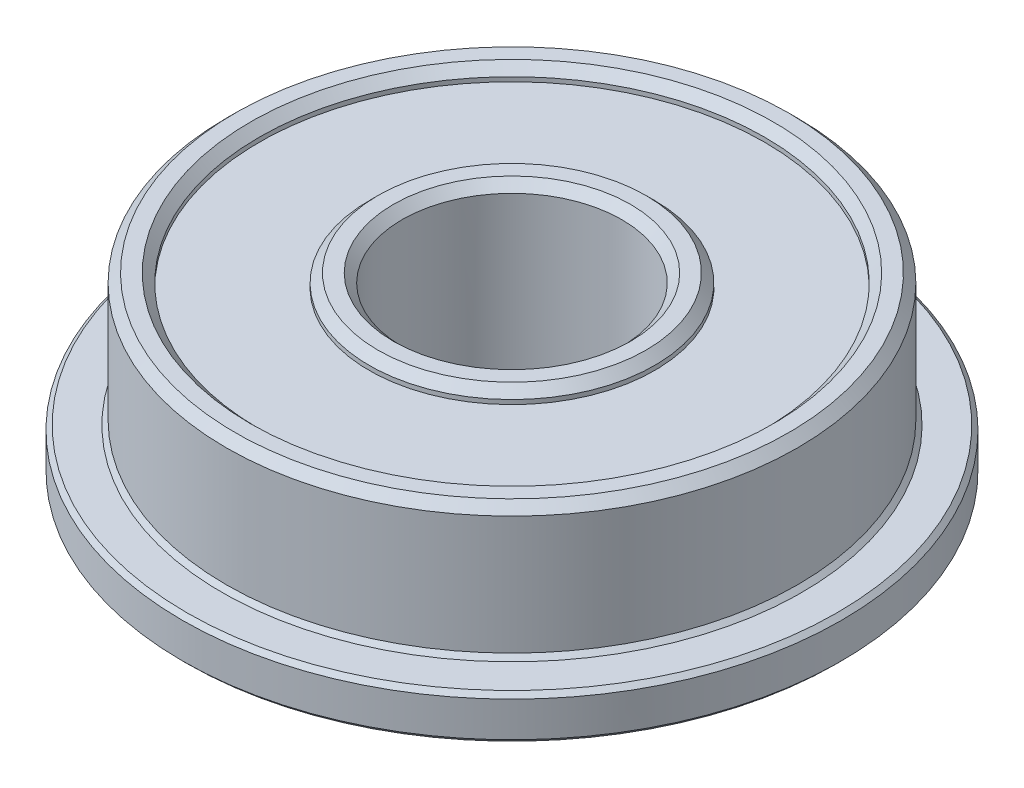
ISO-10303-21;
HEADER;
FILE_DESCRIPTION(('STEP AP214'),'2;1');
FILE_NAME('part.step','',(''),(''),'','','');
FILE_SCHEMA(('AUTOMOTIVE_DESIGN { 1 0 10303 214 1 1 1 1 }'));
ENDSEC;
DATA;
#1=APPLICATION_CONTEXT('core data for automotive mechanical design processes');
#2=APPLICATION_PROTOCOL_DEFINITION('international standard','automotive_design',2000,#1);
#3=PRODUCT_CONTEXT('',#1,'mechanical');
#4=PRODUCT('Part','Part','',(#3));
#5=PRODUCT_RELATED_PRODUCT_CATEGORY('part','',(#4));
#6=PRODUCT_DEFINITION_FORMATION('','',#4);
#7=PRODUCT_DEFINITION_CONTEXT('part definition',#1,'design');
#8=PRODUCT_DEFINITION('design','',#6,#7);
#9=PRODUCT_DEFINITION_SHAPE('','',#8);
#10=(LENGTH_UNIT() NAMED_UNIT(*) SI_UNIT(.MILLI.,.METRE.));
#11=(NAMED_UNIT(*) PLANE_ANGLE_UNIT() SI_UNIT($,.RADIAN.));
#12=(NAMED_UNIT(*) SI_UNIT($,.STERADIAN.) SOLID_ANGLE_UNIT());
#13=UNCERTAINTY_MEASURE_WITH_UNIT(LENGTH_MEASURE(1.E-05),#10,'distance_accuracy_value','');
#14=(GEOMETRIC_REPRESENTATION_CONTEXT(3) GLOBAL_UNCERTAINTY_ASSIGNED_CONTEXT((#13)) GLOBAL_UNIT_ASSIGNED_CONTEXT((#10,
#11,#12)) REPRESENTATION_CONTEXT('',''));
#15=CARTESIAN_POINT('',(0.,0.,0.));
#16=DIRECTION('',(0.,0.,1.));
#17=DIRECTION('',(1.,0.,0.));
#18=AXIS2_PLACEMENT_3D('',#15,#16,#17);
#19=CARTESIAN_POINT('',(0.,0.,0.));
#20=DIRECTION('',(0.,-1.,0.));
#21=DIRECTION('',(0.,0.,-1.));
#22=AXIS2_PLACEMENT_3D('',#19,#20,#21);
#23=PLANE('',#22);
#24=CARTESIAN_POINT('',(0.,0.,0.));
#25=DIRECTION('',(0.,-1.,0.));
#26=DIRECTION('',(0.,0.,-1.));
#27=AXIS2_PLACEMENT_3D('',#24,#25,#26);
#28=CIRCLE('',#27,2.69999999994752);
#29=CARTESIAN_POINT('',(0.,0.,-2.69999999994752));
#30=VERTEX_POINT('',#29);
#31=EDGE_CURVE('E18',#30,#30,#28,.F.);
#32=ORIENTED_EDGE('',*,*,#31,.T.);
#33=EDGE_LOOP('',(#32));
#34=FACE_BOUND('',#33,.T.);
#35=CARTESIAN_POINT('',(0.,-5.68433917557537E-11,0.));
#36=DIRECTION('',(0.,1.,0.));
#37=DIRECTION('',(0.,0.,1.));
#38=AXIS2_PLACEMENT_3D('',#35,#36,#37);
#39=CIRCLE('',#38,3.0500000000302);
#40=CARTESIAN_POINT('',(0.,-5.68440531190789E-11,3.0500000000302));
#41=VERTEX_POINT('',#40);
#42=EDGE_CURVE('E58',#41,#41,#39,.T.);
#43=ORIENTED_EDGE('',*,*,#42,.F.);
#44=EDGE_LOOP('',(#43));
#45=FACE_BOUND('',#44,.T.);
#46=ADVANCED_FACE('F15',(#34,#45),#23,.T.);
#47=CARTESIAN_POINT('',(0.,0.,0.));
#48=DIRECTION('',(0.,-1.,0.));
#49=DIRECTION('',(0.,0.,-1.));
#50=AXIS2_PLACEMENT_3D('',#47,#48,#49);
#51=CONICAL_SURFACE('',#50,2.69999999994752,0.785398163397448);
#52=ORIENTED_EDGE('',*,*,#31,.F.);
#53=EDGE_LOOP('',(#52));
#54=FACE_BOUND('',#53,.T.);
#55=CARTESIAN_POINT('',(0.,0.2,0.));
#56=DIRECTION('',(0.,-1.,0.));
#57=DIRECTION('',(0.,0.,-1.));
#58=AXIS2_PLACEMENT_3D('',#55,#56,#57);
#59=CIRCLE('',#58,2.5);
#60=CARTESIAN_POINT('',(0.,0.200000000000001,-2.5));
#61=VERTEX_POINT('',#60);
#62=EDGE_CURVE('E55',#61,#61,#59,.F.);
#63=ORIENTED_EDGE('',*,*,#62,.T.);
#64=EDGE_LOOP('',(#63));
#65=FACE_BOUND('',#64,.T.);
#66=ADVANCED_FACE('F99',(#54,#65),#51,.F.);
#67=CARTESIAN_POINT('',(0.,0.199999999836109,0.));
#68=DIRECTION('',(0.,1.,0.));
#69=DIRECTION('',(0.,0.,1.));
#70=AXIS2_PLACEMENT_3D('',#67,#68,#69);
#71=CONICAL_SURFACE('',#70,3.24999999992315,0.785398163397448);
#72=ORIENTED_EDGE('',*,*,#42,.T.);
#73=EDGE_LOOP('',(#72));
#74=FACE_BOUND('',#73,.T.);
#75=CARTESIAN_POINT('',(0.,0.2,0.));
#76=DIRECTION('',(0.,1.,0.));
#77=DIRECTION('',(0.,0.,1.));
#78=AXIS2_PLACEMENT_3D('',#75,#76,#77);
#79=CIRCLE('',#78,3.25);
#80=CARTESIAN_POINT('',(0.,0.199999999999999,3.25));
#81=VERTEX_POINT('',#80);
#82=EDGE_CURVE('E51',#81,#81,#79,.T.);
#83=ORIENTED_EDGE('',*,*,#82,.F.);
#84=EDGE_LOOP('',(#83));
#85=FACE_BOUND('',#84,.T.);
#86=ADVANCED_FACE('F102',(#74,#85),#71,.T.);
#87=CARTESIAN_POINT('',(0.,4.,0.));
#88=DIRECTION('',(0.,-1.,0.));
#89=DIRECTION('',(0.,0.,-1.));
#90=AXIS2_PLACEMENT_3D('',#87,#88,#89);
#91=CYLINDRICAL_SURFACE('',#90,2.5);
#92=ORIENTED_EDGE('',*,*,#62,.F.);
#93=EDGE_LOOP('',(#92));
#94=FACE_BOUND('',#93,.T.);
#95=CARTESIAN_POINT('',(0.,3.79999999995562,0.));
#96=DIRECTION('',(0.,1.,0.));
#97=DIRECTION('',(-1.,0.,0.));
#98=AXIS2_PLACEMENT_3D('',#95,#96,#97);
#99=CIRCLE('',#98,2.49999999994088);
#100=CARTESIAN_POINT('',(-2.49999999994088,3.79999999995562,0.));
#101=VERTEX_POINT('',#100);
#102=EDGE_CURVE('E54',#101,#101,#99,.T.);
#103=ORIENTED_EDGE('',*,*,#102,.T.);
#104=EDGE_LOOP('',(#103));
#105=FACE_BOUND('',#104,.T.);
#106=ADVANCED_FACE('F105',(#94,#105),#91,.F.);
#107=CARTESIAN_POINT('',(0.,0.,0.));
#108=DIRECTION('',(0.,1.,0.));
#109=DIRECTION('',(0.,0.,1.));
#110=AXIS2_PLACEMENT_3D('',#107,#108,#109);
#111=CYLINDRICAL_SURFACE('',#110,3.25);
#112=ORIENTED_EDGE('',*,*,#82,.T.);
#113=EDGE_LOOP('',(#112));
#114=FACE_BOUND('',#113,.T.);
#115=CARTESIAN_POINT('',(0.,0.3,0.));
#116=DIRECTION('',(0.,1.,0.));
#117=DIRECTION('',(0.,0.,1.));
#118=AXIS2_PLACEMENT_3D('',#115,#116,#117);
#119=CIRCLE('',#118,3.25);
#120=CARTESIAN_POINT('',(0.,0.299999999999999,3.25));
#121=VERTEX_POINT('',#120);
#122=EDGE_CURVE('E61',#121,#121,#119,.T.);
#123=ORIENTED_EDGE('',*,*,#122,.F.);
#124=EDGE_LOOP('',(#123));
#125=FACE_BOUND('',#124,.T.);
#126=ADVANCED_FACE('F108',(#114,#125),#111,.T.);
#127=CARTESIAN_POINT('',(0.,4.0000000000191,0.));
#128=DIRECTION('',(0.,1.,0.));
#129=DIRECTION('',(0.,0.,1.));
#130=AXIS2_PLACEMENT_3D('',#127,#128,#129);
#131=CONICAL_SURFACE('',#130,2.70000000000437,0.785398163397448);
#132=CARTESIAN_POINT('',(0.,4.0000000000191,0.));
#133=DIRECTION('',(0.,1.,0.));
#134=DIRECTION('',(0.,0.,1.));
#135=AXIS2_PLACEMENT_3D('',#132,#133,#134);
#136=CIRCLE('',#135,2.70000000000437);
#137=CARTESIAN_POINT('',(0.,4.0000000000191,2.70000000000437));
#138=VERTEX_POINT('',#137);
#139=EDGE_CURVE('E87',#138,#138,#136,.F.);
#140=ORIENTED_EDGE('',*,*,#139,.F.);
#141=EDGE_LOOP('',(#140));
#142=FACE_BOUND('',#141,.T.);
#143=ORIENTED_EDGE('',*,*,#102,.F.);
#144=EDGE_LOOP('',(#143));
#145=FACE_BOUND('',#144,.T.);
#146=ADVANCED_FACE('F112',(#142,#145),#131,.F.);
#147=CARTESIAN_POINT('',(0.,0.3,0.));
#148=DIRECTION('',(0.,-1.,0.));
#149=DIRECTION('',(0.,0.,-1.));
#150=AXIS2_PLACEMENT_3D('',#147,#148,#149);
#151=PLANE('',#150);
#152=ORIENTED_EDGE('',*,*,#122,.T.);
#153=EDGE_LOOP('',(#152));
#154=FACE_BOUND('',#153,.T.);
#155=CARTESIAN_POINT('',(0.,0.3,0.));
#156=DIRECTION('',(0.,1.,0.));
#157=DIRECTION('',(0.,0.,1.));
#158=AXIS2_PLACEMENT_3D('',#155,#156,#157);
#159=CIRCLE('',#158,5.75);
#160=CARTESIAN_POINT('',(0.,0.299999999999999,5.75));
#161=VERTEX_POINT('',#160);
#162=EDGE_CURVE('E84',#161,#161,#159,.F.);
#163=ORIENTED_EDGE('',*,*,#162,.T.);
#164=EDGE_LOOP('',(#163));
#165=FACE_BOUND('',#164,.T.);
#166=ADVANCED_FACE('F114',(#154,#165),#151,.T.);
#167=CARTESIAN_POINT('',(0.,4.,0.));
#168=DIRECTION('',(0.,1.,0.));
#169=DIRECTION('',(0.,0.,1.));
#170=AXIS2_PLACEMENT_3D('',#167,#168,#169);
#171=PLANE('',#170);
#172=ORIENTED_EDGE('',*,*,#139,.T.);
#173=EDGE_LOOP('',(#172));
#174=FACE_BOUND('',#173,.T.);
#175=CARTESIAN_POINT('',(0.,3.99999999996226,0.));
#176=DIRECTION('',(0.,-1.,0.));
#177=DIRECTION('',(0.,0.,-1.));
#178=AXIS2_PLACEMENT_3D('',#175,#176,#177);
#179=CIRCLE('',#178,3.0500000000302);
#180=CARTESIAN_POINT('',(0.,3.99999999996226,-3.05000000003019));
#181=VERTEX_POINT('',#180);
#182=EDGE_CURVE('E50',#181,#181,#179,.T.);
#183=ORIENTED_EDGE('',*,*,#182,.F.);
#184=EDGE_LOOP('',(#183));
#185=FACE_BOUND('',#184,.T.);
#186=ADVANCED_FACE('F122',(#174,#185),#171,.T.);
#187=CARTESIAN_POINT('',(0.,0.,0.));
#188=DIRECTION('',(0.,1.,0.));
#189=DIRECTION('',(0.,0.,1.));
#190=AXIS2_PLACEMENT_3D('',#187,#188,#189);
#191=CYLINDRICAL_SURFACE('',#190,5.75);
#192=ORIENTED_EDGE('',*,*,#162,.F.);
#193=EDGE_LOOP('',(#192));
#194=FACE_BOUND('',#193,.T.);
#195=CARTESIAN_POINT('',(0.,0.200000000006639,0.));
#196=DIRECTION('',(0.,-1.,0.));
#197=DIRECTION('',(1.,0.,0.));
#198=AXIS2_PLACEMENT_3D('',#195,#196,#197);
#199=CIRCLE('',#198,5.75000000003456);
#200=CARTESIAN_POINT('',(5.75000000003456,0.200000000006639,0.));
#201=VERTEX_POINT('',#200);
#202=EDGE_CURVE('E47',#201,#201,#199,.T.);
#203=ORIENTED_EDGE('',*,*,#202,.T.);
#204=EDGE_LOOP('',(#203));
#205=FACE_BOUND('',#204,.T.);
#206=ADVANCED_FACE('F190',(#194,#205),#191,.F.);
#207=CARTESIAN_POINT('',(0.,3.80000000001246,0.));
#208=DIRECTION('',(0.,-1.,0.));
#209=DIRECTION('',(0.,0.,-1.));
#210=AXIS2_PLACEMENT_3D('',#207,#208,#209);
#211=CONICAL_SURFACE('',#210,3.24999999997999,0.785398163397448);
#212=ORIENTED_EDGE('',*,*,#182,.T.);
#213=EDGE_LOOP('',(#212));
#214=FACE_BOUND('',#213,.T.);
#215=CARTESIAN_POINT('',(0.,3.8,0.));
#216=DIRECTION('',(0.,-1.,0.));
#217=DIRECTION('',(0.,0.,-1.));
#218=AXIS2_PLACEMENT_3D('',#215,#216,#217);
#219=CIRCLE('',#218,3.25);
#220=CARTESIAN_POINT('',(0.,3.8,-3.25));
#221=VERTEX_POINT('',#220);
#222=EDGE_CURVE('E43',#221,#221,#219,.T.);
#223=ORIENTED_EDGE('',*,*,#222,.F.);
#224=EDGE_LOOP('',(#223));
#225=FACE_BOUND('',#224,.T.);
#226=ADVANCED_FACE('F186',(#214,#225),#211,.T.);
#227=CARTESIAN_POINT('',(0.,5.6843418860808E-11,0.));
#228=DIRECTION('',(0.,-1.,0.));
#229=DIRECTION('',(0.,0.,-1.));
#230=AXIS2_PLACEMENT_3D('',#227,#228,#229);
#231=CONICAL_SURFACE('',#230,5.94999999998436,0.785398163397448);
#232=CARTESIAN_POINT('',(0.,0.,0.));
#233=DIRECTION('',(0.,-1.,0.));
#234=DIRECTION('',(0.,0.,-1.));
#235=AXIS2_PLACEMENT_3D('',#232,#233,#234);
#236=CIRCLE('',#235,5.9500000000412);
#237=CARTESIAN_POINT('',(0.,0.,-5.9500000000412));
#238=VERTEX_POINT('',#237);
#239=EDGE_CURVE('E46',#238,#238,#236,.F.);
#240=ORIENTED_EDGE('',*,*,#239,.F.);
#241=EDGE_LOOP('',(#240));
#242=FACE_BOUND('',#241,.T.);
#243=ORIENTED_EDGE('',*,*,#202,.F.);
#244=EDGE_LOOP('',(#243));
#245=FACE_BOUND('',#244,.T.);
#246=ADVANCED_FACE('F182',(#242,#245),#231,.F.);
#247=CARTESIAN_POINT('',(0.,4.,0.));
#248=DIRECTION('',(0.,-1.,0.));
#249=DIRECTION('',(0.,0.,-1.));
#250=AXIS2_PLACEMENT_3D('',#247,#248,#249);
#251=CYLINDRICAL_SURFACE('',#250,3.25);
#252=ORIENTED_EDGE('',*,*,#222,.T.);
#253=EDGE_LOOP('',(#252));
#254=FACE_BOUND('',#253,.T.);
#255=CARTESIAN_POINT('',(0.,3.7,0.));
#256=DIRECTION('',(0.,-1.,0.));
#257=DIRECTION('',(0.,0.,-1.));
#258=AXIS2_PLACEMENT_3D('',#255,#256,#257);
#259=CIRCLE('',#258,3.25);
#260=CARTESIAN_POINT('',(0.,3.7,-3.25));
#261=VERTEX_POINT('',#260);
#262=EDGE_CURVE('E77',#261,#261,#259,.T.);
#263=ORIENTED_EDGE('',*,*,#262,.F.);
#264=EDGE_LOOP('',(#263));
#265=FACE_BOUND('',#264,.T.);
#266=ADVANCED_FACE('F178',(#254,#265),#251,.T.);
#267=CARTESIAN_POINT('',(0.,0.,0.));
#268=DIRECTION('',(0.,-1.,0.));
#269=DIRECTION('',(0.,0.,-1.));
#270=AXIS2_PLACEMENT_3D('',#267,#268,#269);
#271=PLANE('',#270);
#272=ORIENTED_EDGE('',*,*,#239,.T.);
#273=EDGE_LOOP('',(#272));
#274=FACE_BOUND('',#273,.T.);
#275=CARTESIAN_POINT('',(0.,0.,0.));
#276=DIRECTION('',(0.,1.,0.));
#277=DIRECTION('',(0.,0.,1.));
#278=AXIS2_PLACEMENT_3D('',#275,#276,#277);
#279=CIRCLE('',#278,7.4);
#280=CARTESIAN_POINT('',(0.,0.,7.4));
#281=VERTEX_POINT('',#280);
#282=EDGE_CURVE('E74',#281,#281,#279,.T.);
#283=ORIENTED_EDGE('',*,*,#282,.F.);
#284=EDGE_LOOP('',(#283));
#285=FACE_BOUND('',#284,.T.);
#286=ADVANCED_FACE('F174',(#274,#285),#271,.T.);
#287=CARTESIAN_POINT('',(0.,3.7,0.));
#288=DIRECTION('',(0.,1.,0.));
#289=DIRECTION('',(0.,0.,1.));
#290=AXIS2_PLACEMENT_3D('',#287,#288,#289);
#291=PLANE('',#290);
#292=ORIENTED_EDGE('',*,*,#262,.T.);
#293=EDGE_LOOP('',(#292));
#294=FACE_BOUND('',#293,.T.);
#295=CARTESIAN_POINT('',(0.,3.7,0.));
#296=DIRECTION('',(0.,-1.,0.));
#297=DIRECTION('',(0.,0.,-1.));
#298=AXIS2_PLACEMENT_3D('',#295,#296,#297);
#299=CIRCLE('',#298,5.75);
#300=CARTESIAN_POINT('',(0.,3.7,-5.75));
#301=VERTEX_POINT('',#300);
#302=EDGE_CURVE('E36',#301,#301,#299,.F.);
#303=ORIENTED_EDGE('',*,*,#302,.T.);
#304=EDGE_LOOP('',(#303));
#305=FACE_BOUND('',#304,.T.);
#306=ADVANCED_FACE('F170',(#294,#305),#291,.T.);
#307=CARTESIAN_POINT('',(0.,0.100000000000001,0.));
#308=DIRECTION('',(0.,1.,0.));
#309=DIRECTION('',(0.,0.,1.));
#310=AXIS2_PLACEMENT_3D('',#307,#308,#309);
#311=CONICAL_SURFACE('',#310,7.5,0.785398163397449);
#312=ORIENTED_EDGE('',*,*,#282,.T.);
#313=EDGE_LOOP('',(#312));
#314=FACE_BOUND('',#313,.T.);
#315=CARTESIAN_POINT('',(0.,0.1,0.));
#316=DIRECTION('',(0.,1.,0.));
#317=DIRECTION('',(0.,0.,1.));
#318=AXIS2_PLACEMENT_3D('',#315,#316,#317);
#319=CIRCLE('',#318,7.5);
#320=CARTESIAN_POINT('',(0.,0.1,7.5));
#321=VERTEX_POINT('',#320);
#322=EDGE_CURVE('E32',#321,#321,#319,.T.);
#323=ORIENTED_EDGE('',*,*,#322,.F.);
#324=EDGE_LOOP('',(#323));
#325=FACE_BOUND('',#324,.T.);
#326=ADVANCED_FACE('F166',(#314,#325),#311,.T.);
#327=CARTESIAN_POINT('',(0.,4.,0.));
#328=DIRECTION('',(0.,-1.,0.));
#329=DIRECTION('',(0.,0.,-1.));
#330=AXIS2_PLACEMENT_3D('',#327,#328,#329);
#331=CYLINDRICAL_SURFACE('',#330,5.75);
#332=ORIENTED_EDGE('',*,*,#302,.F.);
#333=EDGE_LOOP('',(#332));
#334=FACE_BOUND('',#333,.T.);
#335=CARTESIAN_POINT('',(0.,3.79999999995562,0.));
#336=DIRECTION('',(0.,1.,0.));
#337=DIRECTION('',(-1.,0.,0.));
#338=AXIS2_PLACEMENT_3D('',#335,#336,#337);
#339=CIRCLE('',#338,5.74999999992087);
#340=CARTESIAN_POINT('',(-5.74999999992087,3.79999999995562,0.));
#341=VERTEX_POINT('',#340);
#342=EDGE_CURVE('E35',#341,#341,#339,.T.);
#343=ORIENTED_EDGE('',*,*,#342,.T.);
#344=EDGE_LOOP('',(#343));
#345=FACE_BOUND('',#344,.T.);
#346=ADVANCED_FACE('F162',(#334,#345),#331,.F.);
#347=CARTESIAN_POINT('',(0.,0.,0.));
#348=DIRECTION('',(0.,1.,0.));
#349=DIRECTION('',(0.,0.,1.));
#350=AXIS2_PLACEMENT_3D('',#347,#348,#349);
#351=CYLINDRICAL_SURFACE('',#350,7.5);
#352=ORIENTED_EDGE('',*,*,#322,.T.);
#353=EDGE_LOOP('',(#352));
#354=FACE_BOUND('',#353,.T.);
#355=CARTESIAN_POINT('',(0.,0.9,0.));
#356=DIRECTION('',(0.,-1.,0.));
#357=DIRECTION('',(1.,0.,0.));
#358=AXIS2_PLACEMENT_3D('',#355,#356,#357);
#359=CIRCLE('',#358,7.5);
#360=CARTESIAN_POINT('',(7.5,0.9,0.));
#361=VERTEX_POINT('',#360);
#362=EDGE_CURVE('E37',#361,#361,#359,.F.);
#363=ORIENTED_EDGE('',*,*,#362,.F.);
#364=EDGE_LOOP('',(#363));
#365=FACE_BOUND('',#364,.T.);
#366=ADVANCED_FACE('F158',(#354,#365),#351,.T.);
#367=CARTESIAN_POINT('',(0.,3.99999999990541,0.));
#368=DIRECTION('',(0.,1.,0.));
#369=DIRECTION('',(0.,0.,1.));
#370=AXIS2_PLACEMENT_3D('',#367,#368,#369);
#371=CONICAL_SURFACE('',#370,5.94999999987067,0.785398163397448);
#372=CARTESIAN_POINT('',(0.,3.99999999996226,0.));
#373=DIRECTION('',(0.,1.,0.));
#374=DIRECTION('',(0.,0.,1.));
#375=AXIS2_PLACEMENT_3D('',#372,#373,#374);
#376=CIRCLE('',#375,5.94999999992751);
#377=CARTESIAN_POINT('',(0.,3.99999999996225,5.94999999992751));
#378=VERTEX_POINT('',#377);
#379=EDGE_CURVE('E40',#378,#378,#376,.F.);
#380=ORIENTED_EDGE('',*,*,#379,.F.);
#381=EDGE_LOOP('',(#380));
#382=FACE_BOUND('',#381,.T.);
#383=ORIENTED_EDGE('',*,*,#342,.F.);
#384=EDGE_LOOP('',(#383));
#385=FACE_BOUND('',#384,.T.);
#386=ADVANCED_FACE('F154',(#382,#385),#371,.F.);
#387=CARTESIAN_POINT('',(0.,0.899999999999999,0.));
#388=DIRECTION('',(0.,-1.,0.));
#389=DIRECTION('',(0.,0.,-1.));
#390=AXIS2_PLACEMENT_3D('',#387,#388,#389);
#391=CONICAL_SURFACE('',#390,7.5,0.785398163397447);
#392=CARTESIAN_POINT('',(0.,1.,0.));
#393=DIRECTION('',(0.,-1.,0.));
#394=DIRECTION('',(0.,0.,-1.));
#395=AXIS2_PLACEMENT_3D('',#392,#393,#394);
#396=CIRCLE('',#395,7.4);
#397=CARTESIAN_POINT('',(0.,1.,-7.4));
#398=VERTEX_POINT('',#397);
#399=EDGE_CURVE('E67',#398,#398,#396,.F.);
#400=ORIENTED_EDGE('',*,*,#399,.F.);
#401=EDGE_LOOP('',(#400));
#402=FACE_BOUND('',#401,.T.);
#403=ORIENTED_EDGE('',*,*,#362,.T.);
#404=EDGE_LOOP('',(#403));
#405=FACE_BOUND('',#404,.T.);
#406=ADVANCED_FACE('F150',(#402,#405),#391,.T.);
#407=CARTESIAN_POINT('',(0.,4.,0.));
#408=DIRECTION('',(0.,1.,0.));
#409=DIRECTION('',(0.,0.,1.));
#410=AXIS2_PLACEMENT_3D('',#407,#408,#409);
#411=PLANE('',#410);
#412=ORIENTED_EDGE('',*,*,#379,.T.);
#413=EDGE_LOOP('',(#412));
#414=FACE_BOUND('',#413,.T.);
#415=CARTESIAN_POINT('',(0.,4.0000000000191,0.));
#416=DIRECTION('',(0.,-1.,0.));
#417=DIRECTION('',(0.,0.,-1.));
#418=AXIS2_PLACEMENT_3D('',#415,#416,#417);
#419=CIRCLE('',#418,6.29999999995334);
#420=CARTESIAN_POINT('',(0.,4.0000000000191,-6.29999999995334));
#421=VERTEX_POINT('',#420);
#422=EDGE_CURVE('E64',#421,#421,#419,.T.);
#423=ORIENTED_EDGE('',*,*,#422,.F.);
#424=EDGE_LOOP('',(#423));
#425=FACE_BOUND('',#424,.T.);
#426=ADVANCED_FACE('F146',(#414,#425),#411,.T.);
#427=CARTESIAN_POINT('',(0.,1.,0.));
#428=DIRECTION('',(0.,1.,0.));
#429=DIRECTION('',(0.,0.,1.));
#430=AXIS2_PLACEMENT_3D('',#427,#428,#429);
#431=PLANE('',#430);
#432=CARTESIAN_POINT('',(0.,1.0000000000332,0.));
#433=DIRECTION('',(0.,-1.,0.));
#434=DIRECTION('',(0.,0.,-1.));
#435=AXIS2_PLACEMENT_3D('',#432,#433,#434);
#436=CIRCLE('',#435,6.59999999999172);
#437=CARTESIAN_POINT('',(0.,1.0000000000332,-6.59999999999172));
#438=VERTEX_POINT('',#437);
#439=EDGE_CURVE('E27',#438,#438,#436,.F.);
#440=ORIENTED_EDGE('',*,*,#439,.F.);
#441=EDGE_LOOP('',(#440));
#442=FACE_BOUND('',#441,.T.);
#443=ORIENTED_EDGE('',*,*,#399,.T.);
#444=EDGE_LOOP('',(#443));
#445=FACE_BOUND('',#444,.T.);
#446=ADVANCED_FACE('F142',(#442,#445),#431,.T.);
#447=CARTESIAN_POINT('',(0.,3.79999999995562,0.));
#448=DIRECTION('',(0.,-1.,0.));
#449=DIRECTION('',(0.,0.,-1.));
#450=AXIS2_PLACEMENT_3D('',#447,#448,#449);
#451=CONICAL_SURFACE('',#450,6.50000000001683,0.785398163397448);
#452=ORIENTED_EDGE('',*,*,#422,.T.);
#453=EDGE_LOOP('',(#452));
#454=FACE_BOUND('',#453,.T.);
#455=CARTESIAN_POINT('',(0.,3.8,0.));
#456=DIRECTION('',(0.,1.,0.));
#457=DIRECTION('',(0.,0.,1.));
#458=AXIS2_PLACEMENT_3D('',#455,#456,#457);
#459=CIRCLE('',#458,6.5);
#460=CARTESIAN_POINT('',(0.,3.8,6.5));
#461=VERTEX_POINT('',#460);
#462=EDGE_CURVE('E22',#461,#461,#459,.F.);
#463=ORIENTED_EDGE('',*,*,#462,.F.);
#464=EDGE_LOOP('',(#463));
#465=FACE_BOUND('',#464,.T.);
#466=ADVANCED_FACE('F135',(#454,#465),#451,.T.);
#467=CARTESIAN_POINT('',(0.,1.0000000000332,0.));
#468=DIRECTION('',(0.,-1.,0.));
#469=DIRECTION('',(0.,0.,-1.));
#470=AXIS2_PLACEMENT_3D('',#467,#468,#469);
#471=CONICAL_SURFACE('',#470,6.59999999999172,0.785398163397448);
#472=CARTESIAN_POINT('',(0.,1.1,0.));
#473=DIRECTION('',(0.,1.,0.));
#474=DIRECTION('',(0.,0.,1.));
#475=AXIS2_PLACEMENT_3D('',#472,#473,#474);
#476=CIRCLE('',#475,6.5);
#477=CARTESIAN_POINT('',(0.,1.1,6.5));
#478=VERTEX_POINT('',#477);
#479=EDGE_CURVE('E10',#478,#478,#476,.T.);
#480=ORIENTED_EDGE('',*,*,#479,.F.);
#481=EDGE_LOOP('',(#480));
#482=FACE_BOUND('',#481,.T.);
#483=ORIENTED_EDGE('',*,*,#439,.T.);
#484=EDGE_LOOP('',(#483));
#485=FACE_BOUND('',#484,.T.);
#486=ADVANCED_FACE('F130',(#482,#485),#471,.T.);
#487=CARTESIAN_POINT('',(0.,2.,0.));
#488=DIRECTION('',(0.,1.,0.));
#489=DIRECTION('',(0.,0.,1.));
#490=AXIS2_PLACEMENT_3D('',#487,#488,#489);
#491=CYLINDRICAL_SURFACE('',#490,6.5);
#492=ORIENTED_EDGE('',*,*,#479,.T.);
#493=EDGE_LOOP('',(#492));
#494=FACE_BOUND('',#493,.T.);
#495=ORIENTED_EDGE('',*,*,#462,.T.);
#496=EDGE_LOOP('',(#495));
#497=FACE_BOUND('',#496,.T.);
#498=ADVANCED_FACE('F128',(#494,#497),#491,.T.);
#499=CLOSED_SHELL('',(#46,#66,#86,#106,#126,#146,#166,#186,#206,#226,#246,#266,#286,#306,#326,
#346,#366,#386,#406,#426,#446,#466,#486,#498));
#500=MANIFOLD_SOLID_BREP('B1',#499);
#501=ADVANCED_BREP_SHAPE_REPRESENTATION('',(#18,#500),#14);
#502=SHAPE_DEFINITION_REPRESENTATION(#9,#501);
ENDSEC;
END-ISO-10303-21;
